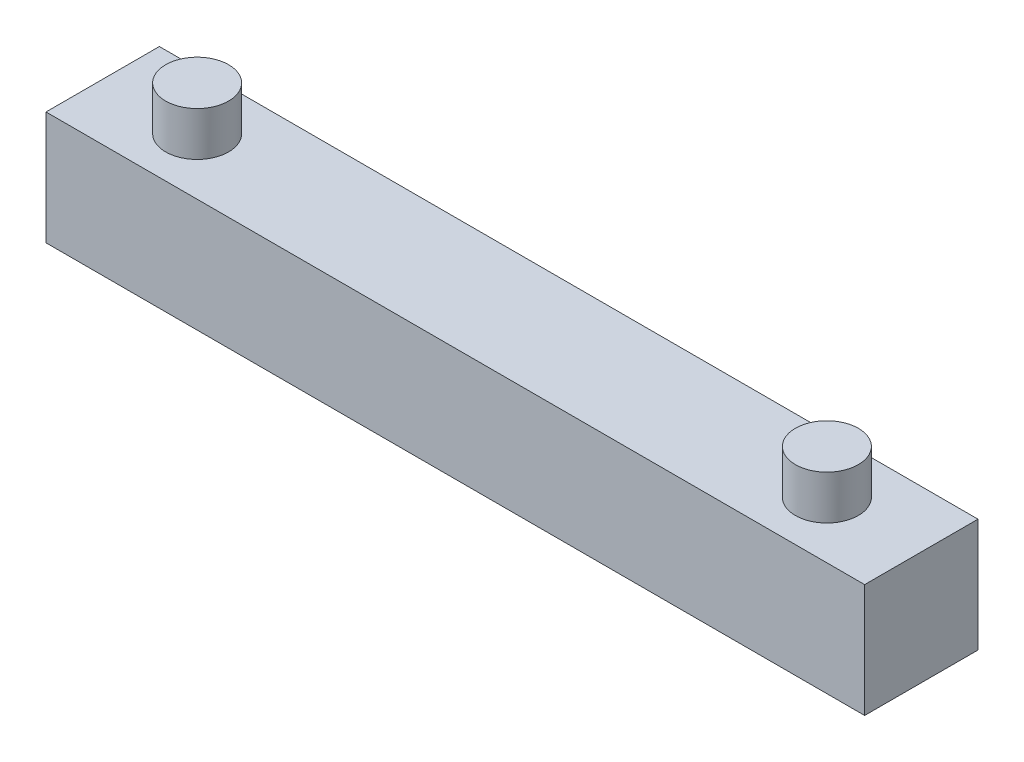
ISO-10303-21;
HEADER;
FILE_DESCRIPTION(('STEP AP214'),'2;1');
FILE_NAME('part.step','',(''),(''),'','','');
FILE_SCHEMA(('AUTOMOTIVE_DESIGN { 1 0 10303 214 1 1 1 1 }'));
ENDSEC;
DATA;
#1=APPLICATION_CONTEXT('core data for automotive mechanical design processes');
#2=APPLICATION_PROTOCOL_DEFINITION('international standard','automotive_design',2000,#1);
#3=PRODUCT_CONTEXT('',#1,'mechanical');
#4=PRODUCT('Part','Part','',(#3));
#5=PRODUCT_RELATED_PRODUCT_CATEGORY('part','',(#4));
#6=PRODUCT_DEFINITION_FORMATION('','',#4);
#7=PRODUCT_DEFINITION_CONTEXT('part definition',#1,'design');
#8=PRODUCT_DEFINITION('design','',#6,#7);
#9=PRODUCT_DEFINITION_SHAPE('','',#8);
#10=(LENGTH_UNIT() NAMED_UNIT(*) SI_UNIT(.MILLI.,.METRE.));
#11=(NAMED_UNIT(*) PLANE_ANGLE_UNIT() SI_UNIT($,.RADIAN.));
#12=(NAMED_UNIT(*) SI_UNIT($,.STERADIAN.) SOLID_ANGLE_UNIT());
#13=UNCERTAINTY_MEASURE_WITH_UNIT(LENGTH_MEASURE(1.E-05),#10,'distance_accuracy_value','');
#14=(GEOMETRIC_REPRESENTATION_CONTEXT(3) GLOBAL_UNCERTAINTY_ASSIGNED_CONTEXT((#13)) GLOBAL_UNIT_ASSIGNED_CONTEXT((#10,
#11,#12)) REPRESENTATION_CONTEXT('',''));
#15=CARTESIAN_POINT('',(0.,0.,0.));
#16=DIRECTION('',(0.,0.,1.));
#17=DIRECTION('',(1.,0.,0.));
#18=AXIS2_PLACEMENT_3D('',#15,#16,#17);
#19=CARTESIAN_POINT('',(0.,0.,9.));
#20=DIRECTION('',(1.,0.,0.));
#21=DIRECTION('',(0.,0.,-1.));
#22=AXIS2_PLACEMENT_3D('',#19,#20,#21);
#23=PLANE('',#22);
#24=DIRECTION('',(0.,-1.,0.));
#25=VECTOR('',#24,1.);
#26=CARTESIAN_POINT('',(0.,0.,0.));
#27=LINE('',#26,#25);
#28=CARTESIAN_POINT('',(0.,9.,0.));
#29=VERTEX_POINT('',#28);
#30=CARTESIAN_POINT('',(0.,0.,0.));
#31=VERTEX_POINT('',#30);
#32=EDGE_CURVE('E100',#29,#31,#27,.T.);
#33=ORIENTED_EDGE('',*,*,#32,.T.);
#34=DIRECTION('',(0.,0.,-1.));
#35=VECTOR('',#34,1.);
#36=CARTESIAN_POINT('',(0.,0.,9.));
#37=LINE('',#36,#35);
#38=CARTESIAN_POINT('',(0.,0.,9.));
#39=VERTEX_POINT('',#38);
#40=EDGE_CURVE('E91',#39,#31,#37,.T.);
#41=ORIENTED_EDGE('',*,*,#40,.F.);
#42=DIRECTION('',(0.,-1.,0.));
#43=VECTOR('',#42,1.);
#44=CARTESIAN_POINT('',(0.,0.,9.));
#45=LINE('',#44,#43);
#46=CARTESIAN_POINT('',(0.,9.,9.));
#47=VERTEX_POINT('',#46);
#48=EDGE_CURVE('E85',#47,#39,#45,.T.);
#49=ORIENTED_EDGE('',*,*,#48,.F.);
#50=DIRECTION('',(0.,0.,-1.));
#51=VECTOR('',#50,1.);
#52=CARTESIAN_POINT('',(0.,9.,9.));
#53=LINE('',#52,#51);
#54=EDGE_CURVE('E96',#47,#29,#53,.T.);
#55=ORIENTED_EDGE('',*,*,#54,.T.);
#56=EDGE_LOOP('',(#33,#41,#49,#55));
#57=FACE_BOUND('',#56,.T.);
#58=ADVANCED_FACE('F33',(#57),#23,.F.);
#59=CARTESIAN_POINT('',(0.,0.,9.));
#60=DIRECTION('',(0.,1.,0.));
#61=DIRECTION('',(0.,0.,1.));
#62=AXIS2_PLACEMENT_3D('',#59,#60,#61);
#63=PLANE('',#62);
#64=DIRECTION('',(1.,0.,0.));
#65=VECTOR('',#64,1.);
#66=CARTESIAN_POINT('',(0.,0.,0.));
#67=LINE('',#66,#65);
#68=CARTESIAN_POINT('',(65.,0.,0.));
#69=VERTEX_POINT('',#68);
#70=EDGE_CURVE('E90',#31,#69,#67,.T.);
#71=ORIENTED_EDGE('',*,*,#70,.T.);
#72=DIRECTION('',(0.,0.,-1.));
#73=VECTOR('',#72,1.);
#74=CARTESIAN_POINT('',(65.,0.,9.));
#75=LINE('',#74,#73);
#76=CARTESIAN_POINT('',(65.,0.,9.));
#77=VERTEX_POINT('',#76);
#78=EDGE_CURVE('E88',#77,#69,#75,.T.);
#79=ORIENTED_EDGE('',*,*,#78,.F.);
#80=DIRECTION('',(1.,0.,0.));
#81=VECTOR('',#80,1.);
#82=CARTESIAN_POINT('',(0.,0.,9.));
#83=LINE('',#82,#81);
#84=EDGE_CURVE('E80',#39,#77,#83,.T.);
#85=ORIENTED_EDGE('',*,*,#84,.F.);
#86=ORIENTED_EDGE('',*,*,#40,.T.);
#87=EDGE_LOOP('',(#71,#79,#85,#86));
#88=FACE_BOUND('',#87,.T.);
#89=ADVANCED_FACE('F89',(#88),#63,.F.);
#90=CARTESIAN_POINT('',(65.,0.,9.));
#91=DIRECTION('',(-1.,0.,0.));
#92=DIRECTION('',(0.,0.,1.));
#93=AXIS2_PLACEMENT_3D('',#90,#91,#92);
#94=PLANE('',#93);
#95=DIRECTION('',(0.,1.,0.));
#96=VECTOR('',#95,1.);
#97=CARTESIAN_POINT('',(65.,0.,0.));
#98=LINE('',#97,#96);
#99=CARTESIAN_POINT('',(65.,9.,0.));
#100=VERTEX_POINT('',#99);
#101=EDGE_CURVE('E66',#69,#100,#98,.T.);
#102=ORIENTED_EDGE('',*,*,#101,.T.);
#103=DIRECTION('',(0.,0.,-1.));
#104=VECTOR('',#103,1.);
#105=CARTESIAN_POINT('',(65.,9.,9.));
#106=LINE('',#105,#104);
#107=CARTESIAN_POINT('',(65.,9.,9.));
#108=VERTEX_POINT('',#107);
#109=EDGE_CURVE('E92',#108,#100,#106,.T.);
#110=ORIENTED_EDGE('',*,*,#109,.F.);
#111=DIRECTION('',(0.,1.,0.));
#112=VECTOR('',#111,1.);
#113=CARTESIAN_POINT('',(65.,0.,9.));
#114=LINE('',#113,#112);
#115=EDGE_CURVE('E83',#77,#108,#114,.T.);
#116=ORIENTED_EDGE('',*,*,#115,.F.);
#117=ORIENTED_EDGE('',*,*,#78,.T.);
#118=EDGE_LOOP('',(#102,#110,#116,#117));
#119=FACE_BOUND('',#118,.T.);
#120=ADVANCED_FACE('F94',(#119),#94,.F.);
#121=CARTESIAN_POINT('',(0.,9.,9.));
#122=DIRECTION('',(0.,-1.,0.));
#123=DIRECTION('',(0.,0.,-1.));
#124=AXIS2_PLACEMENT_3D('',#121,#122,#123);
#125=PLANE('',#124);
#126=CARTESIAN_POINT('',(57.5,9.,4.5));
#127=DIRECTION('',(0.,-1.,0.));
#128=DIRECTION('',(0.,0.,-1.));
#129=AXIS2_PLACEMENT_3D('',#126,#127,#128);
#130=CIRCLE('',#129,2.5);
#131=CARTESIAN_POINT('',(57.5,9.,2.));
#132=VERTEX_POINT('',#131);
#133=EDGE_CURVE('E11',#132,#132,#130,.F.);
#134=ORIENTED_EDGE('',*,*,#133,.F.);
#135=EDGE_LOOP('',(#134));
#136=FACE_BOUND('',#135,.T.);
#137=CARTESIAN_POINT('',(7.5,9.,4.5));
#138=DIRECTION('',(0.,-1.,0.));
#139=DIRECTION('',(0.,0.,-1.));
#140=AXIS2_PLACEMENT_3D('',#137,#138,#139);
#141=CIRCLE('',#140,2.5);
#142=CARTESIAN_POINT('',(7.5,9.,2.));
#143=VERTEX_POINT('',#142);
#144=EDGE_CURVE('E41',#143,#143,#141,.F.);
#145=ORIENTED_EDGE('',*,*,#144,.F.);
#146=EDGE_LOOP('',(#145));
#147=FACE_BOUND('',#146,.T.);
#148=DIRECTION('',(-1.,0.,0.));
#149=VECTOR('',#148,1.);
#150=CARTESIAN_POINT('',(0.,9.,0.));
#151=LINE('',#150,#149);
#152=EDGE_CURVE('E72',#100,#29,#151,.T.);
#153=ORIENTED_EDGE('',*,*,#152,.T.);
#154=ORIENTED_EDGE('',*,*,#54,.F.);
#155=DIRECTION('',(-1.,0.,0.));
#156=VECTOR('',#155,1.);
#157=CARTESIAN_POINT('',(0.,9.,9.));
#158=LINE('',#157,#156);
#159=EDGE_CURVE('E49',#108,#47,#158,.T.);
#160=ORIENTED_EDGE('',*,*,#159,.F.);
#161=ORIENTED_EDGE('',*,*,#109,.T.);
#162=EDGE_LOOP('',(#153,#154,#160,#161));
#163=FACE_BOUND('',#162,.T.);
#164=ADVANCED_FACE('F114',(#136,#147,#163),#125,.F.);
#165=CARTESIAN_POINT('',(0.,0.,9.));
#166=DIRECTION('',(0.,0.,-1.));
#167=DIRECTION('',(-1.,0.,0.));
#168=AXIS2_PLACEMENT_3D('',#165,#166,#167);
#169=PLANE('',#168);
#170=ORIENTED_EDGE('',*,*,#48,.T.);
#171=ORIENTED_EDGE('',*,*,#84,.T.);
#172=ORIENTED_EDGE('',*,*,#115,.T.);
#173=ORIENTED_EDGE('',*,*,#159,.T.);
#174=EDGE_LOOP('',(#170,#171,#172,#173));
#175=FACE_BOUND('',#174,.T.);
#176=ADVANCED_FACE('F81',(#175),#169,.F.);
#177=CARTESIAN_POINT('',(0.,0.,0.));
#178=DIRECTION('',(0.,0.,-1.));
#179=DIRECTION('',(-1.,0.,0.));
#180=AXIS2_PLACEMENT_3D('',#177,#178,#179);
#181=PLANE('',#180);
#182=ORIENTED_EDGE('',*,*,#32,.F.);
#183=ORIENTED_EDGE('',*,*,#152,.F.);
#184=ORIENTED_EDGE('',*,*,#101,.F.);
#185=ORIENTED_EDGE('',*,*,#70,.F.);
#186=EDGE_LOOP('',(#182,#183,#184,#185));
#187=FACE_BOUND('',#186,.T.);
#188=ADVANCED_FACE('F122',(#187),#181,.T.);
#189=CARTESIAN_POINT('',(7.5,12.5,4.5));
#190=DIRECTION('',(0.,-1.,0.));
#191=DIRECTION('',(0.,0.,-1.));
#192=AXIS2_PLACEMENT_3D('',#189,#190,#191);
#193=CYLINDRICAL_SURFACE('',#192,2.5);
#194=CARTESIAN_POINT('',(7.5,12.5,4.5));
#195=DIRECTION('',(0.,1.,0.));
#196=DIRECTION('',(0.,0.,1.));
#197=AXIS2_PLACEMENT_3D('',#194,#195,#196);
#198=CIRCLE('',#197,2.5);
#199=CARTESIAN_POINT('',(7.5,12.5,7.));
#200=VERTEX_POINT('',#199);
#201=EDGE_CURVE('E103',#200,#200,#198,.T.);
#202=ORIENTED_EDGE('',*,*,#201,.F.);
#203=EDGE_LOOP('',(#202));
#204=FACE_BOUND('',#203,.T.);
#205=ORIENTED_EDGE('',*,*,#144,.T.);
#206=EDGE_LOOP('',(#205));
#207=FACE_BOUND('',#206,.T.);
#208=ADVANCED_FACE('F112',(#204,#207),#193,.T.);
#209=CARTESIAN_POINT('',(7.5,12.5,4.5));
#210=DIRECTION('',(0.,1.,0.));
#211=DIRECTION('',(0.,0.,1.));
#212=AXIS2_PLACEMENT_3D('',#209,#210,#211);
#213=PLANE('',#212);
#214=ORIENTED_EDGE('',*,*,#201,.T.);
#215=EDGE_LOOP('',(#214));
#216=FACE_BOUND('',#215,.T.);
#217=ADVANCED_FACE('F138',(#216),#213,.T.);
#218=CARTESIAN_POINT('',(57.5,12.5,4.5));
#219=DIRECTION('',(0.,-1.,0.));
#220=DIRECTION('',(0.,0.,-1.));
#221=AXIS2_PLACEMENT_3D('',#218,#219,#220);
#222=CYLINDRICAL_SURFACE('',#221,2.5);
#223=CARTESIAN_POINT('',(57.5,12.5,4.5));
#224=DIRECTION('',(0.,1.,0.));
#225=DIRECTION('',(0.,0.,1.));
#226=AXIS2_PLACEMENT_3D('',#223,#224,#225);
#227=CIRCLE('',#226,2.5);
#228=CARTESIAN_POINT('',(57.5,12.5,7.));
#229=VERTEX_POINT('',#228);
#230=EDGE_CURVE('E156',#229,#229,#227,.T.);
#231=ORIENTED_EDGE('',*,*,#230,.F.);
#232=EDGE_LOOP('',(#231));
#233=FACE_BOUND('',#232,.T.);
#234=ORIENTED_EDGE('',*,*,#133,.T.);
#235=EDGE_LOOP('',(#234));
#236=FACE_BOUND('',#235,.T.);
#237=ADVANCED_FACE('F144',(#233,#236),#222,.T.);
#238=CARTESIAN_POINT('',(57.5,12.5,4.5));
#239=DIRECTION('',(0.,1.,0.));
#240=DIRECTION('',(0.,0.,1.));
#241=AXIS2_PLACEMENT_3D('',#238,#239,#240);
#242=PLANE('',#241);
#243=ORIENTED_EDGE('',*,*,#230,.T.);
#244=EDGE_LOOP('',(#243));
#245=FACE_BOUND('',#244,.T.);
#246=ADVANCED_FACE('F148',(#245),#242,.T.);
#247=CLOSED_SHELL('',(#58,#89,#120,#164,#176,#188,#208,#217,#237,#246));
#248=MANIFOLD_SOLID_BREP('B2',#247);
#249=ADVANCED_BREP_SHAPE_REPRESENTATION('',(#18,#248),#14);
#250=SHAPE_DEFINITION_REPRESENTATION(#9,#249);
ENDSEC;
END-ISO-10303-21;
